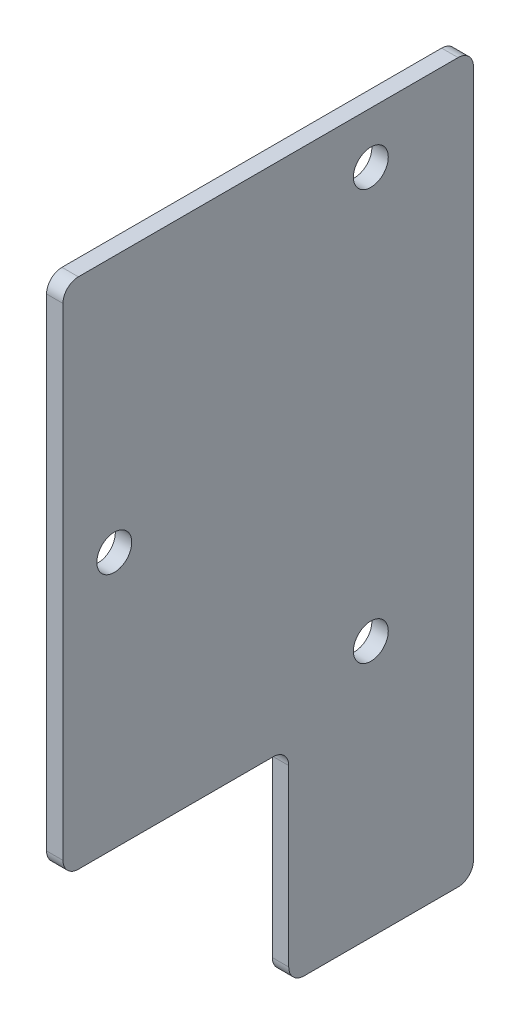
ISO-10303-21;
HEADER;
FILE_DESCRIPTION(('STEP AP214'),'2;1');
FILE_NAME('part.step','',(''),(''),'','','');
FILE_SCHEMA(('AUTOMOTIVE_DESIGN { 1 0 10303 214 1 1 1 1 }'));
ENDSEC;
DATA;
#1=APPLICATION_CONTEXT('core data for automotive mechanical design processes');
#2=APPLICATION_PROTOCOL_DEFINITION('international standard','automotive_design',2000,#1);
#3=PRODUCT_CONTEXT('',#1,'mechanical');
#4=PRODUCT('Part','Part','',(#3));
#5=PRODUCT_RELATED_PRODUCT_CATEGORY('part','',(#4));
#6=PRODUCT_DEFINITION_FORMATION('','',#4);
#7=PRODUCT_DEFINITION_CONTEXT('part definition',#1,'design');
#8=PRODUCT_DEFINITION('design','',#6,#7);
#9=PRODUCT_DEFINITION_SHAPE('','',#8);
#10=(LENGTH_UNIT() NAMED_UNIT(*) SI_UNIT(.MILLI.,.METRE.));
#11=(NAMED_UNIT(*) PLANE_ANGLE_UNIT() SI_UNIT($,.RADIAN.));
#12=(NAMED_UNIT(*) SI_UNIT($,.STERADIAN.) SOLID_ANGLE_UNIT());
#13=UNCERTAINTY_MEASURE_WITH_UNIT(LENGTH_MEASURE(1.E-05),#10,'distance_accuracy_value','');
#14=(GEOMETRIC_REPRESENTATION_CONTEXT(3) GLOBAL_UNCERTAINTY_ASSIGNED_CONTEXT((#13)) GLOBAL_UNIT_ASSIGNED_CONTEXT((#10,
#11,#12)) REPRESENTATION_CONTEXT('',''));
#15=CARTESIAN_POINT('',(0.,0.,0.));
#16=DIRECTION('',(0.,0.,1.));
#17=DIRECTION('',(1.,0.,0.));
#18=AXIS2_PLACEMENT_3D('',#15,#16,#17);
#19=CARTESIAN_POINT('',(1.6002,25.,-20.));
#20=DIRECTION('',(0.,0.,1.));
#21=DIRECTION('',(0.,-1.,0.));
#22=AXIS2_PLACEMENT_3D('',#19,#20,#21);
#23=PLANE('',#22);
#24=DIRECTION('',(0.,1.,0.));
#25=VECTOR('',#24,1.);
#26=CARTESIAN_POINT('',(1.6002,-45.,-20.));
#27=LINE('',#26,#25);
#28=CARTESIAN_POINT('',(1.6002,-43.5,-20.));
#29=VERTEX_POINT('',#28);
#30=CARTESIAN_POINT('',(1.6002,23.5,-20.));
#31=VERTEX_POINT('',#30);
#32=EDGE_CURVE('E149',#29,#31,#27,.T.);
#33=ORIENTED_EDGE('',*,*,#32,.F.);
#34=DIRECTION('',(-1.,0.,0.));
#35=VECTOR('',#34,1.);
#36=CARTESIAN_POINT('',(1.6002,-43.5,-20.));
#37=LINE('',#36,#35);
#38=CARTESIAN_POINT('',(0.,-43.5,-20.));
#39=VERTEX_POINT('',#38);
#40=EDGE_CURVE('E133',#29,#39,#37,.T.);
#41=ORIENTED_EDGE('',*,*,#40,.T.);
#42=DIRECTION('',(0.,1.,0.));
#43=VECTOR('',#42,1.);
#44=CARTESIAN_POINT('',(0.,25.,-20.));
#45=LINE('',#44,#43);
#46=CARTESIAN_POINT('',(0.,23.5,-20.));
#47=VERTEX_POINT('',#46);
#48=EDGE_CURVE('E146',#39,#47,#45,.T.);
#49=ORIENTED_EDGE('',*,*,#48,.T.);
#50=DIRECTION('',(-1.,0.,0.));
#51=VECTOR('',#50,1.);
#52=CARTESIAN_POINT('',(1.6002,23.5,-20.));
#53=LINE('',#52,#51);
#54=EDGE_CURVE('E152',#47,#31,#53,.F.);
#55=ORIENTED_EDGE('',*,*,#54,.T.);
#56=EDGE_LOOP('',(#33,#41,#49,#55));
#57=FACE_BOUND('',#56,.T.);
#58=ADVANCED_FACE('F39',(#57),#23,.F.);
#59=CARTESIAN_POINT('',(1.6002,25.,20.));
#60=DIRECTION('',(0.,-1.,0.));
#61=DIRECTION('',(0.,0.,-1.));
#62=AXIS2_PLACEMENT_3D('',#59,#60,#61);
#63=PLANE('',#62);
#64=DIRECTION('',(0.,0.,1.));
#65=VECTOR('',#64,1.);
#66=CARTESIAN_POINT('',(1.6002,25.,20.));
#67=LINE('',#66,#65);
#68=CARTESIAN_POINT('',(1.6002,25.,-18.5));
#69=VERTEX_POINT('',#68);
#70=CARTESIAN_POINT('',(1.6002,25.,18.5));
#71=VERTEX_POINT('',#70);
#72=EDGE_CURVE('E268',#69,#71,#67,.T.);
#73=ORIENTED_EDGE('',*,*,#72,.F.);
#74=DIRECTION('',(-1.,0.,0.));
#75=VECTOR('',#74,1.);
#76=CARTESIAN_POINT('',(1.6002,25.,-18.5));
#77=LINE('',#76,#75);
#78=CARTESIAN_POINT('',(0.,25.,-18.5));
#79=VERTEX_POINT('',#78);
#80=EDGE_CURVE('E240',#69,#79,#77,.T.);
#81=ORIENTED_EDGE('',*,*,#80,.T.);
#82=DIRECTION('',(0.,0.,1.));
#83=VECTOR('',#82,1.);
#84=CARTESIAN_POINT('',(0.,25.,20.));
#85=LINE('',#84,#83);
#86=CARTESIAN_POINT('',(0.,25.,18.5));
#87=VERTEX_POINT('',#86);
#88=EDGE_CURVE('E158',#79,#87,#85,.T.);
#89=ORIENTED_EDGE('',*,*,#88,.T.);
#90=DIRECTION('',(-1.,0.,0.));
#91=VECTOR('',#90,1.);
#92=CARTESIAN_POINT('',(1.6002,25.,18.5));
#93=LINE('',#92,#91);
#94=EDGE_CURVE('E237',#87,#71,#93,.F.);
#95=ORIENTED_EDGE('',*,*,#94,.T.);
#96=EDGE_LOOP('',(#73,#81,#89,#95));
#97=FACE_BOUND('',#96,.T.);
#98=ADVANCED_FACE('F319',(#97),#63,.F.);
#99=CARTESIAN_POINT('',(1.6002,25.,20.));
#100=DIRECTION('',(0.,0.,-1.));
#101=DIRECTION('',(0.,1.,0.));
#102=AXIS2_PLACEMENT_3D('',#99,#100,#101);
#103=PLANE('',#102);
#104=DIRECTION('',(0.,-1.,0.));
#105=VECTOR('',#104,1.);
#106=CARTESIAN_POINT('',(0.,25.,20.));
#107=LINE('',#106,#105);
#108=CARTESIAN_POINT('',(0.,23.5,20.));
#109=VERTEX_POINT('',#108);
#110=CARTESIAN_POINT('',(0.,-23.5,20.));
#111=VERTEX_POINT('',#110);
#112=EDGE_CURVE('E164',#109,#111,#107,.T.);
#113=ORIENTED_EDGE('',*,*,#112,.T.);
#114=DIRECTION('',(-1.,0.,0.));
#115=VECTOR('',#114,1.);
#116=CARTESIAN_POINT('',(1.6002,-23.5,20.));
#117=LINE('',#116,#115);
#118=CARTESIAN_POINT('',(1.6002,-23.5,20.));
#119=VERTEX_POINT('',#118);
#120=EDGE_CURVE('E234',#111,#119,#117,.F.);
#121=ORIENTED_EDGE('',*,*,#120,.T.);
#122=DIRECTION('',(0.,-1.,0.));
#123=VECTOR('',#122,1.);
#124=CARTESIAN_POINT('',(1.6002,25.,20.));
#125=LINE('',#124,#123);
#126=CARTESIAN_POINT('',(1.6002,23.5,20.));
#127=VERTEX_POINT('',#126);
#128=EDGE_CURVE('E262',#127,#119,#125,.T.);
#129=ORIENTED_EDGE('',*,*,#128,.F.);
#130=DIRECTION('',(-1.,0.,0.));
#131=VECTOR('',#130,1.);
#132=CARTESIAN_POINT('',(1.6002,23.5,20.));
#133=LINE('',#132,#131);
#134=EDGE_CURVE('E230',#127,#109,#133,.T.);
#135=ORIENTED_EDGE('',*,*,#134,.T.);
#136=EDGE_LOOP('',(#113,#121,#129,#135));
#137=FACE_BOUND('',#136,.T.);
#138=ADVANCED_FACE('F324',(#137),#103,.F.);
#139=CARTESIAN_POINT('',(1.6002,-25.,20.));
#140=DIRECTION('',(0.,1.,0.));
#141=DIRECTION('',(0.,0.,1.));
#142=AXIS2_PLACEMENT_3D('',#139,#140,#141);
#143=PLANE('',#142);
#144=DIRECTION('',(0.,0.,-1.));
#145=VECTOR('',#144,1.);
#146=CARTESIAN_POINT('',(0.,-25.,20.));
#147=LINE('',#146,#145);
#148=CARTESIAN_POINT('',(0.,-25.,18.5));
#149=VERTEX_POINT('',#148);
#150=CARTESIAN_POINT('',(0.,-25.,-0.500000000000004));
#151=VERTEX_POINT('',#150);
#152=EDGE_CURVE('E176',#149,#151,#147,.T.);
#153=ORIENTED_EDGE('',*,*,#152,.T.);
#154=DIRECTION('',(-1.,0.,0.));
#155=VECTOR('',#154,1.);
#156=CARTESIAN_POINT('',(1.6002,-25.,-0.500000000000005));
#157=LINE('',#156,#155);
#158=CARTESIAN_POINT('',(1.6002,-25.,-0.500000000000004));
#159=VERTEX_POINT('',#158);
#160=EDGE_CURVE('E227',#151,#159,#157,.F.);
#161=ORIENTED_EDGE('',*,*,#160,.T.);
#162=DIRECTION('',(0.,0.,-1.));
#163=VECTOR('',#162,1.);
#164=CARTESIAN_POINT('',(1.6002,-25.,20.));
#165=LINE('',#164,#163);
#166=CARTESIAN_POINT('',(1.6002,-25.,18.5));
#167=VERTEX_POINT('',#166);
#168=EDGE_CURVE('E258',#167,#159,#165,.T.);
#169=ORIENTED_EDGE('',*,*,#168,.F.);
#170=DIRECTION('',(-1.,0.,0.));
#171=VECTOR('',#170,1.);
#172=CARTESIAN_POINT('',(1.6002,-25.,18.5));
#173=LINE('',#172,#171);
#174=EDGE_CURVE('E223',#167,#149,#173,.T.);
#175=ORIENTED_EDGE('',*,*,#174,.T.);
#176=EDGE_LOOP('',(#153,#161,#169,#175));
#177=FACE_BOUND('',#176,.T.);
#178=ADVANCED_FACE('F250',(#177),#143,.F.);
#179=CARTESIAN_POINT('',(1.6002,-25.,-2.00000000000001));
#180=DIRECTION('',(0.,0.,-1.));
#181=DIRECTION('',(0.,1.,0.));
#182=AXIS2_PLACEMENT_3D('',#179,#180,#181);
#183=PLANE('',#182);
#184=DIRECTION('',(0.,-1.,0.));
#185=VECTOR('',#184,1.);
#186=CARTESIAN_POINT('',(0.,-25.,-2.00000000000001));
#187=LINE('',#186,#185);
#188=CARTESIAN_POINT('',(0.,-26.5,-2.00000000000001));
#189=VERTEX_POINT('',#188);
#190=CARTESIAN_POINT('',(0.,-43.5,-2.00000000000001));
#191=VERTEX_POINT('',#190);
#192=EDGE_CURVE('E180',#189,#191,#187,.T.);
#193=ORIENTED_EDGE('',*,*,#192,.T.);
#194=DIRECTION('',(-1.,0.,0.));
#195=VECTOR('',#194,1.);
#196=CARTESIAN_POINT('',(1.6002,-43.5,-2.00000000000001));
#197=LINE('',#196,#195);
#198=CARTESIAN_POINT('',(1.6002,-43.5,-2.00000000000001));
#199=VERTEX_POINT('',#198);
#200=EDGE_CURVE('E55',#191,#199,#197,.F.);
#201=ORIENTED_EDGE('',*,*,#200,.T.);
#202=DIRECTION('',(0.,-1.,0.));
#203=VECTOR('',#202,1.);
#204=CARTESIAN_POINT('',(1.6002,-25.,-2.00000000000001));
#205=LINE('',#204,#203);
#206=CARTESIAN_POINT('',(1.6002,-26.5,-2.00000000000001));
#207=VERTEX_POINT('',#206);
#208=EDGE_CURVE('E255',#207,#199,#205,.T.);
#209=ORIENTED_EDGE('',*,*,#208,.F.);
#210=DIRECTION('',(-1.,0.,0.));
#211=VECTOR('',#210,1.);
#212=CARTESIAN_POINT('',(0.,-26.5,-2.00000000000001));
#213=LINE('',#212,#211);
#214=EDGE_CURVE('E217',#207,#189,#213,.T.);
#215=ORIENTED_EDGE('',*,*,#214,.T.);
#216=EDGE_LOOP('',(#193,#201,#209,#215));
#217=FACE_BOUND('',#216,.T.);
#218=ADVANCED_FACE('F254',(#217),#183,.F.);
#219=CARTESIAN_POINT('',(1.6002,-45.,-2.00000000000001));
#220=DIRECTION('',(0.,1.,0.));
#221=DIRECTION('',(0.,0.,1.));
#222=AXIS2_PLACEMENT_3D('',#219,#220,#221);
#223=PLANE('',#222);
#224=DIRECTION('',(0.,0.,-1.));
#225=VECTOR('',#224,1.);
#226=CARTESIAN_POINT('',(0.,-45.,-2.00000000000001));
#227=LINE('',#226,#225);
#228=CARTESIAN_POINT('',(0.,-45.,-3.50000000000001));
#229=VERTEX_POINT('',#228);
#230=CARTESIAN_POINT('',(0.,-45.,-18.5));
#231=VERTEX_POINT('',#230);
#232=EDGE_CURVE('E183',#229,#231,#227,.T.);
#233=ORIENTED_EDGE('',*,*,#232,.T.);
#234=DIRECTION('',(-1.,0.,0.));
#235=VECTOR('',#234,1.);
#236=CARTESIAN_POINT('',(1.6002,-45.,-18.5));
#237=LINE('',#236,#235);
#238=CARTESIAN_POINT('',(1.6002,-45.,-18.5));
#239=VERTEX_POINT('',#238);
#240=EDGE_CURVE('E134',#231,#239,#237,.F.);
#241=ORIENTED_EDGE('',*,*,#240,.T.);
#242=DIRECTION('',(0.,0.,-1.));
#243=VECTOR('',#242,1.);
#244=CARTESIAN_POINT('',(1.6002,-45.,-2.00000000000001));
#245=LINE('',#244,#243);
#246=CARTESIAN_POINT('',(1.6002,-45.,-3.50000000000001));
#247=VERTEX_POINT('',#246);
#248=EDGE_CURVE('E170',#247,#239,#245,.T.);
#249=ORIENTED_EDGE('',*,*,#248,.F.);
#250=DIRECTION('',(-1.,0.,0.));
#251=VECTOR('',#250,1.);
#252=CARTESIAN_POINT('',(1.6002,-45.,-3.50000000000001));
#253=LINE('',#252,#251);
#254=EDGE_CURVE('E140',#247,#229,#253,.T.);
#255=ORIENTED_EDGE('',*,*,#254,.T.);
#256=EDGE_LOOP('',(#233,#241,#249,#255));
#257=FACE_BOUND('',#256,.T.);
#258=ADVANCED_FACE('F299',(#257),#223,.F.);
#259=CARTESIAN_POINT('',(1.6002,0.,0.));
#260=DIRECTION('',(-1.,0.,0.));
#261=DIRECTION('',(0.,0.,1.));
#262=AXIS2_PLACEMENT_3D('',#259,#260,#261);
#263=PLANE('',#262);
#264=CARTESIAN_POINT('',(1.6002,20.,-10.));
#265=DIRECTION('',(1.,0.,0.));
#266=DIRECTION('',(0.,0.,-1.));
#267=AXIS2_PLACEMENT_3D('',#264,#265,#266);
#268=CIRCLE('',#267,1.7);
#269=CARTESIAN_POINT('',(1.6002,20.,-11.7));
#270=VERTEX_POINT('',#269);
#271=EDGE_CURVE('E289',#270,#270,#268,.T.);
#272=ORIENTED_EDGE('',*,*,#271,.F.);
#273=EDGE_LOOP('',(#272));
#274=FACE_BOUND('',#273,.T.);
#275=CARTESIAN_POINT('',(1.6002,-20.,-10.));
#276=DIRECTION('',(1.,0.,0.));
#277=DIRECTION('',(0.,0.,-1.));
#278=AXIS2_PLACEMENT_3D('',#275,#276,#277);
#279=CIRCLE('',#278,1.7);
#280=CARTESIAN_POINT('',(1.6002,-20.,-11.7));
#281=VERTEX_POINT('',#280);
#282=EDGE_CURVE('E281',#281,#281,#279,.T.);
#283=ORIENTED_EDGE('',*,*,#282,.F.);
#284=EDGE_LOOP('',(#283));
#285=FACE_BOUND('',#284,.T.);
#286=CARTESIAN_POINT('',(1.6002,0.,15.));
#287=DIRECTION('',(1.,0.,0.));
#288=DIRECTION('',(0.,0.,-1.));
#289=AXIS2_PLACEMENT_3D('',#286,#287,#288);
#290=CIRCLE('',#289,1.7);
#291=CARTESIAN_POINT('',(1.6002,0.,13.3));
#292=VERTEX_POINT('',#291);
#293=EDGE_CURVE('E167',#292,#292,#290,.T.);
#294=ORIENTED_EDGE('',*,*,#293,.F.);
#295=EDGE_LOOP('',(#294));
#296=FACE_BOUND('',#295,.T.);
#297=ORIENTED_EDGE('',*,*,#248,.T.);
#298=CARTESIAN_POINT('',(1.6002,-43.5,-18.5));
#299=DIRECTION('',(-1.,0.,0.));
#300=DIRECTION('',(0.,0.,1.));
#301=AXIS2_PLACEMENT_3D('',#298,#299,#300);
#302=CIRCLE('',#301,1.5);
#303=EDGE_CURVE('E214',#239,#29,#302,.F.);
#304=ORIENTED_EDGE('',*,*,#303,.T.);
#305=ORIENTED_EDGE('',*,*,#32,.T.);
#306=CARTESIAN_POINT('',(1.6002,23.5,-18.5));
#307=DIRECTION('',(-1.,0.,0.));
#308=DIRECTION('',(0.,0.,1.));
#309=AXIS2_PLACEMENT_3D('',#306,#307,#308);
#310=CIRCLE('',#309,1.5);
#311=EDGE_CURVE('E205',#31,#69,#310,.F.);
#312=ORIENTED_EDGE('',*,*,#311,.T.);
#313=ORIENTED_EDGE('',*,*,#72,.T.);
#314=CARTESIAN_POINT('',(1.6002,23.5,18.5));
#315=DIRECTION('',(-1.,0.,0.));
#316=DIRECTION('',(0.,0.,1.));
#317=AXIS2_PLACEMENT_3D('',#314,#315,#316);
#318=CIRCLE('',#317,1.5);
#319=EDGE_CURVE('E202',#71,#127,#318,.F.);
#320=ORIENTED_EDGE('',*,*,#319,.T.);
#321=ORIENTED_EDGE('',*,*,#128,.T.);
#322=CARTESIAN_POINT('',(1.6002,-23.5,18.5));
#323=DIRECTION('',(-1.,0.,0.));
#324=DIRECTION('',(0.,0.,1.));
#325=AXIS2_PLACEMENT_3D('',#322,#323,#324);
#326=CIRCLE('',#325,1.5);
#327=EDGE_CURVE('E208',#119,#167,#326,.F.);
#328=ORIENTED_EDGE('',*,*,#327,.T.);
#329=ORIENTED_EDGE('',*,*,#168,.T.);
#330=CARTESIAN_POINT('',(1.6002,-26.5,-0.500000000000005));
#331=DIRECTION('',(-1.,0.,0.));
#332=DIRECTION('',(0.,0.,1.));
#333=AXIS2_PLACEMENT_3D('',#330,#331,#332);
#334=CIRCLE('',#333,1.5);
#335=EDGE_CURVE('E11',#159,#207,#334,.T.);
#336=ORIENTED_EDGE('',*,*,#335,.T.);
#337=ORIENTED_EDGE('',*,*,#208,.T.);
#338=CARTESIAN_POINT('',(1.6002,-43.5,-3.50000000000001));
#339=DIRECTION('',(-1.,0.,0.));
#340=DIRECTION('',(0.,0.,1.));
#341=AXIS2_PLACEMENT_3D('',#338,#339,#340);
#342=CIRCLE('',#341,1.5);
#343=EDGE_CURVE('E211',#199,#247,#342,.F.);
#344=ORIENTED_EDGE('',*,*,#343,.T.);
#345=EDGE_LOOP('',(#297,#304,#305,#312,#313,#320,#321,#328,#329,#336,#337,#344));
#346=FACE_BOUND('',#345,.T.);
#347=ADVANCED_FACE('F296',(#274,#285,#296,#346),#263,.F.);
#348=CARTESIAN_POINT('',(0.,0.,0.));
#349=DIRECTION('',(-1.,0.,0.));
#350=DIRECTION('',(0.,0.,1.));
#351=AXIS2_PLACEMENT_3D('',#348,#349,#350);
#352=PLANE('',#351);
#353=CARTESIAN_POINT('',(0.,20.,-10.));
#354=DIRECTION('',(-1.,0.,0.));
#355=DIRECTION('',(0.,0.,1.));
#356=AXIS2_PLACEMENT_3D('',#353,#354,#355);
#357=CIRCLE('',#356,1.7);
#358=CARTESIAN_POINT('',(0.,20.,-8.3));
#359=VERTEX_POINT('',#358);
#360=EDGE_CURVE('E285',#359,#359,#357,.T.);
#361=ORIENTED_EDGE('',*,*,#360,.F.);
#362=EDGE_LOOP('',(#361));
#363=FACE_BOUND('',#362,.T.);
#364=CARTESIAN_POINT('',(0.,-20.,-10.));
#365=DIRECTION('',(-1.,0.,0.));
#366=DIRECTION('',(0.,0.,1.));
#367=AXIS2_PLACEMENT_3D('',#364,#365,#366);
#368=CIRCLE('',#367,1.7);
#369=CARTESIAN_POINT('',(0.,-20.,-8.30000000000001));
#370=VERTEX_POINT('',#369);
#371=EDGE_CURVE('E277',#370,#370,#368,.T.);
#372=ORIENTED_EDGE('',*,*,#371,.F.);
#373=EDGE_LOOP('',(#372));
#374=FACE_BOUND('',#373,.T.);
#375=CARTESIAN_POINT('',(0.,0.,15.));
#376=DIRECTION('',(-1.,0.,0.));
#377=DIRECTION('',(0.,0.,1.));
#378=AXIS2_PLACEMENT_3D('',#375,#376,#377);
#379=CIRCLE('',#378,1.7);
#380=CARTESIAN_POINT('',(0.,0.,16.7));
#381=VERTEX_POINT('',#380);
#382=EDGE_CURVE('E159',#381,#381,#379,.T.);
#383=ORIENTED_EDGE('',*,*,#382,.F.);
#384=EDGE_LOOP('',(#383));
#385=FACE_BOUND('',#384,.T.);
#386=ORIENTED_EDGE('',*,*,#48,.F.);
#387=CARTESIAN_POINT('',(0.,-43.5,-18.5));
#388=DIRECTION('',(-1.,0.,0.));
#389=DIRECTION('',(0.,0.,1.));
#390=AXIS2_PLACEMENT_3D('',#387,#388,#389);
#391=CIRCLE('',#390,1.5);
#392=EDGE_CURVE('E129',#39,#231,#391,.T.);
#393=ORIENTED_EDGE('',*,*,#392,.T.);
#394=ORIENTED_EDGE('',*,*,#232,.F.);
#395=CARTESIAN_POINT('',(0.,-43.5,-3.50000000000001));
#396=DIRECTION('',(-1.,0.,0.));
#397=DIRECTION('',(0.,0.,1.));
#398=AXIS2_PLACEMENT_3D('',#395,#396,#397);
#399=CIRCLE('',#398,1.5);
#400=EDGE_CURVE('E141',#229,#191,#399,.T.);
#401=ORIENTED_EDGE('',*,*,#400,.T.);
#402=ORIENTED_EDGE('',*,*,#192,.F.);
#403=CARTESIAN_POINT('',(0.,-26.5,-0.500000000000005));
#404=DIRECTION('',(-1.,0.,0.));
#405=DIRECTION('',(0.,0.,1.));
#406=AXIS2_PLACEMENT_3D('',#403,#404,#405);
#407=CIRCLE('',#406,1.5);
#408=EDGE_CURVE('E48',#189,#151,#407,.F.);
#409=ORIENTED_EDGE('',*,*,#408,.T.);
#410=ORIENTED_EDGE('',*,*,#152,.F.);
#411=CARTESIAN_POINT('',(0.,-23.5,18.5));
#412=DIRECTION('',(-1.,0.,0.));
#413=DIRECTION('',(0.,0.,1.));
#414=AXIS2_PLACEMENT_3D('',#411,#412,#413);
#415=CIRCLE('',#414,1.5);
#416=EDGE_CURVE('E192',#149,#111,#415,.T.);
#417=ORIENTED_EDGE('',*,*,#416,.T.);
#418=ORIENTED_EDGE('',*,*,#112,.F.);
#419=CARTESIAN_POINT('',(0.,23.5,18.5));
#420=DIRECTION('',(-1.,0.,0.));
#421=DIRECTION('',(0.,0.,1.));
#422=AXIS2_PLACEMENT_3D('',#419,#420,#421);
#423=CIRCLE('',#422,1.5);
#424=EDGE_CURVE('E151',#109,#87,#423,.T.);
#425=ORIENTED_EDGE('',*,*,#424,.T.);
#426=ORIENTED_EDGE('',*,*,#88,.F.);
#427=CARTESIAN_POINT('',(0.,23.5,-18.5));
#428=DIRECTION('',(-1.,0.,0.));
#429=DIRECTION('',(0.,0.,1.));
#430=AXIS2_PLACEMENT_3D('',#427,#428,#429);
#431=CIRCLE('',#430,1.5);
#432=EDGE_CURVE('E156',#79,#47,#431,.T.);
#433=ORIENTED_EDGE('',*,*,#432,.T.);
#434=EDGE_LOOP('',(#386,#393,#394,#401,#402,#409,#410,#417,#418,#425,#426,#433));
#435=FACE_BOUND('',#434,.T.);
#436=ADVANCED_FACE('F154',(#363,#374,#385,#435),#352,.T.);
#437=CARTESIAN_POINT('',(1.6002,0.,15.));
#438=DIRECTION('',(1.,0.,0.));
#439=DIRECTION('',(0.,0.,-1.));
#440=AXIS2_PLACEMENT_3D('',#437,#438,#439);
#441=CYLINDRICAL_SURFACE('',#440,1.7);
#442=ORIENTED_EDGE('',*,*,#382,.T.);
#443=EDGE_LOOP('',(#442));
#444=FACE_BOUND('',#443,.T.);
#445=ORIENTED_EDGE('',*,*,#293,.T.);
#446=EDGE_LOOP('',(#445));
#447=FACE_BOUND('',#446,.T.);
#448=ADVANCED_FACE('F338',(#444,#447),#441,.F.);
#449=CARTESIAN_POINT('',(1.6002,-20.,-10.));
#450=DIRECTION('',(1.,0.,0.));
#451=DIRECTION('',(0.,0.,-1.));
#452=AXIS2_PLACEMENT_3D('',#449,#450,#451);
#453=CYLINDRICAL_SURFACE('',#452,1.7);
#454=ORIENTED_EDGE('',*,*,#371,.T.);
#455=EDGE_LOOP('',(#454));
#456=FACE_BOUND('',#455,.T.);
#457=ORIENTED_EDGE('',*,*,#282,.T.);
#458=EDGE_LOOP('',(#457));
#459=FACE_BOUND('',#458,.T.);
#460=ADVANCED_FACE('F343',(#456,#459),#453,.F.);
#461=CARTESIAN_POINT('',(1.6002,20.,-10.));
#462=DIRECTION('',(1.,0.,0.));
#463=DIRECTION('',(0.,0.,-1.));
#464=AXIS2_PLACEMENT_3D('',#461,#462,#463);
#465=CYLINDRICAL_SURFACE('',#464,1.7);
#466=ORIENTED_EDGE('',*,*,#360,.T.);
#467=EDGE_LOOP('',(#466));
#468=FACE_BOUND('',#467,.T.);
#469=ORIENTED_EDGE('',*,*,#271,.T.);
#470=EDGE_LOOP('',(#469));
#471=FACE_BOUND('',#470,.T.);
#472=ADVANCED_FACE('F294',(#468,#471),#465,.F.);
#473=CARTESIAN_POINT('',(1.6002,-43.5,-18.5));
#474=DIRECTION('',(-1.,0.,0.));
#475=DIRECTION('',(0.,0.,1.));
#476=AXIS2_PLACEMENT_3D('',#473,#474,#475);
#477=CYLINDRICAL_SURFACE('',#476,1.5);
#478=ORIENTED_EDGE('',*,*,#303,.F.);
#479=ORIENTED_EDGE('',*,*,#240,.F.);
#480=ORIENTED_EDGE('',*,*,#392,.F.);
#481=ORIENTED_EDGE('',*,*,#40,.F.);
#482=EDGE_LOOP('',(#478,#479,#480,#481));
#483=FACE_BOUND('',#482,.T.);
#484=ADVANCED_FACE('F132',(#483),#477,.T.);
#485=CARTESIAN_POINT('',(1.6002,-43.5,-3.50000000000001));
#486=DIRECTION('',(-1.,0.,0.));
#487=DIRECTION('',(0.,0.,1.));
#488=AXIS2_PLACEMENT_3D('',#485,#486,#487);
#489=CYLINDRICAL_SURFACE('',#488,1.5);
#490=ORIENTED_EDGE('',*,*,#343,.F.);
#491=ORIENTED_EDGE('',*,*,#200,.F.);
#492=ORIENTED_EDGE('',*,*,#400,.F.);
#493=ORIENTED_EDGE('',*,*,#254,.F.);
#494=EDGE_LOOP('',(#490,#491,#492,#493));
#495=FACE_BOUND('',#494,.T.);
#496=ADVANCED_FACE('F308',(#495),#489,.T.);
#497=CARTESIAN_POINT('',(1.6002,-26.5,-0.500000000000005));
#498=DIRECTION('',(1.,0.,0.));
#499=DIRECTION('',(0.,0.,-1.));
#500=AXIS2_PLACEMENT_3D('',#497,#498,#499);
#501=CYLINDRICAL_SURFACE('',#500,1.5);
#502=ORIENTED_EDGE('',*,*,#335,.F.);
#503=ORIENTED_EDGE('',*,*,#160,.F.);
#504=ORIENTED_EDGE('',*,*,#408,.F.);
#505=ORIENTED_EDGE('',*,*,#214,.F.);
#506=EDGE_LOOP('',(#502,#503,#504,#505));
#507=FACE_BOUND('',#506,.T.);
#508=ADVANCED_FACE('F253',(#507),#501,.F.);
#509=CARTESIAN_POINT('',(1.6002,-23.5,18.5));
#510=DIRECTION('',(-1.,0.,0.));
#511=DIRECTION('',(0.,0.,1.));
#512=AXIS2_PLACEMENT_3D('',#509,#510,#511);
#513=CYLINDRICAL_SURFACE('',#512,1.5);
#514=ORIENTED_EDGE('',*,*,#327,.F.);
#515=ORIENTED_EDGE('',*,*,#120,.F.);
#516=ORIENTED_EDGE('',*,*,#416,.F.);
#517=ORIENTED_EDGE('',*,*,#174,.F.);
#518=EDGE_LOOP('',(#514,#515,#516,#517));
#519=FACE_BOUND('',#518,.T.);
#520=ADVANCED_FACE('F315',(#519),#513,.T.);
#521=CARTESIAN_POINT('',(1.6002,23.5,-18.5));
#522=DIRECTION('',(-1.,0.,0.));
#523=DIRECTION('',(0.,0.,1.));
#524=AXIS2_PLACEMENT_3D('',#521,#522,#523);
#525=CYLINDRICAL_SURFACE('',#524,1.5);
#526=ORIENTED_EDGE('',*,*,#311,.F.);
#527=ORIENTED_EDGE('',*,*,#54,.F.);
#528=ORIENTED_EDGE('',*,*,#432,.F.);
#529=ORIENTED_EDGE('',*,*,#80,.F.);
#530=EDGE_LOOP('',(#526,#527,#528,#529));
#531=FACE_BOUND('',#530,.T.);
#532=ADVANCED_FACE('F388',(#531),#525,.T.);
#533=CARTESIAN_POINT('',(1.6002,23.5,18.5));
#534=DIRECTION('',(-1.,0.,0.));
#535=DIRECTION('',(0.,0.,1.));
#536=AXIS2_PLACEMENT_3D('',#533,#534,#535);
#537=CYLINDRICAL_SURFACE('',#536,1.5);
#538=ORIENTED_EDGE('',*,*,#319,.F.);
#539=ORIENTED_EDGE('',*,*,#94,.F.);
#540=ORIENTED_EDGE('',*,*,#424,.F.);
#541=ORIENTED_EDGE('',*,*,#134,.F.);
#542=EDGE_LOOP('',(#538,#539,#540,#541));
#543=FACE_BOUND('',#542,.T.);
#544=ADVANCED_FACE('F41',(#543),#537,.T.);
#545=CLOSED_SHELL('',(#58,#98,#138,#178,#218,#258,#347,#436,#448,#460,#472,#484,#496,#508,#520,
#532,#544));
#546=MANIFOLD_SOLID_BREP('B2',#545);
#547=ADVANCED_BREP_SHAPE_REPRESENTATION('',(#18,#546),#14);
#548=SHAPE_DEFINITION_REPRESENTATION(#9,#547);
ENDSEC;
END-ISO-10303-21;
